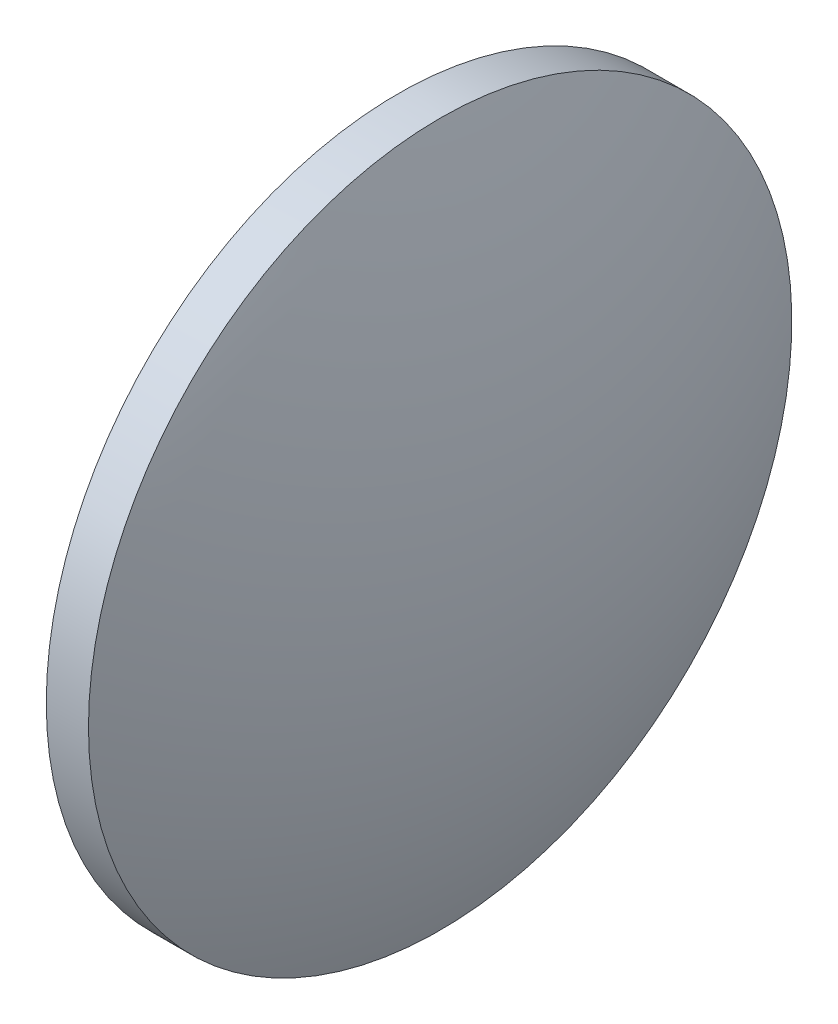
ISO-10303-21;
HEADER;
FILE_DESCRIPTION(('STEP AP214'),'2;1');
FILE_NAME('part.step','',(''),(''),'','','');
FILE_SCHEMA(('AUTOMOTIVE_DESIGN { 1 0 10303 214 1 1 1 1 }'));
ENDSEC;
DATA;
#1=APPLICATION_CONTEXT('core data for automotive mechanical design processes');
#2=APPLICATION_PROTOCOL_DEFINITION('international standard','automotive_design',2000,#1);
#3=PRODUCT_CONTEXT('',#1,'mechanical');
#4=PRODUCT('Part','Part','',(#3));
#5=PRODUCT_RELATED_PRODUCT_CATEGORY('part','',(#4));
#6=PRODUCT_DEFINITION_FORMATION('','',#4);
#7=PRODUCT_DEFINITION_CONTEXT('part definition',#1,'design');
#8=PRODUCT_DEFINITION('design','',#6,#7);
#9=PRODUCT_DEFINITION_SHAPE('','',#8);
#10=(LENGTH_UNIT() NAMED_UNIT(*) SI_UNIT(.MILLI.,.METRE.));
#11=(NAMED_UNIT(*) PLANE_ANGLE_UNIT() SI_UNIT($,.RADIAN.));
#12=(NAMED_UNIT(*) SI_UNIT($,.STERADIAN.) SOLID_ANGLE_UNIT());
#13=UNCERTAINTY_MEASURE_WITH_UNIT(LENGTH_MEASURE(1.E-05),#10,'distance_accuracy_value','');
#14=(GEOMETRIC_REPRESENTATION_CONTEXT(3) GLOBAL_UNCERTAINTY_ASSIGNED_CONTEXT((#13)) GLOBAL_UNIT_ASSIGNED_CONTEXT((#10,
#11,#12)) REPRESENTATION_CONTEXT('',''));
#15=CARTESIAN_POINT('',(0.,0.,0.));
#16=DIRECTION('',(0.,0.,1.));
#17=DIRECTION('',(1.,0.,0.));
#18=AXIS2_PLACEMENT_3D('',#15,#16,#17);
#19=CARTESIAN_POINT('',(521.162815002526,7.57456525703877,0.));
#20=DIRECTION('',(-1.,0.,0.));
#21=DIRECTION('',(0.,1.,0.));
#22=AXIS2_PLACEMENT_3D('',#19,#20,#21);
#23=SPHERICAL_SURFACE('',#22,32.5000000000001);
#24=CARTESIAN_POINT('',(551.162815002526,7.57456525703878,0.));
#25=DIRECTION('',(-1.,0.,0.));
#26=DIRECTION('',(0.,0.,1.));
#27=AXIS2_PLACEMENT_3D('',#24,#25,#26);
#28=CIRCLE('',#27,12.5);
#29=CARTESIAN_POINT('',(551.162815002526,7.57456525703878,12.5));
#30=VERTEX_POINT('',#29);
#31=EDGE_CURVE('E10',#30,#30,#28,.T.);
#32=ORIENTED_EDGE('',*,*,#31,.F.);
#33=EDGE_LOOP('',(#32));
#34=FACE_BOUND('',#33,.T.);
#35=ADVANCED_FACE('F35',(#34),#23,.T.);
#36=CARTESIAN_POINT('',(547.633707424089,7.57456525703878,0.));
#37=DIRECTION('',(-1.,0.,0.));
#38=DIRECTION('',(0.,0.,1.));
#39=AXIS2_PLACEMENT_3D('',#36,#37,#38);
#40=CYLINDRICAL_SURFACE('',#39,12.5);
#41=CARTESIAN_POINT('',(549.662815002526,7.57456525703878,0.));
#42=DIRECTION('',(-1.,0.,0.));
#43=DIRECTION('',(0.,0.,1.));
#44=AXIS2_PLACEMENT_3D('',#41,#42,#43);
#45=CIRCLE('',#44,12.5);
#46=CARTESIAN_POINT('',(549.662815002526,7.57456525703878,12.5));
#47=VERTEX_POINT('',#46);
#48=EDGE_CURVE('E41',#47,#47,#45,.T.);
#49=ORIENTED_EDGE('',*,*,#48,.F.);
#50=EDGE_LOOP('',(#49));
#51=FACE_BOUND('',#50,.T.);
#52=ORIENTED_EDGE('',*,*,#31,.T.);
#53=EDGE_LOOP('',(#52));
#54=FACE_BOUND('',#53,.T.);
#55=ADVANCED_FACE('F49',(#51,#54),#40,.T.);
#56=CARTESIAN_POINT('',(549.662815002526,7.57456525703878,0.));
#57=DIRECTION('',(1.,0.,0.));
#58=DIRECTION('',(0.,0.,-1.));
#59=AXIS2_PLACEMENT_3D('',#56,#57,#58);
#60=PLANE('',#59);
#61=ORIENTED_EDGE('',*,*,#48,.T.);
#62=EDGE_LOOP('',(#61));
#63=FACE_BOUND('',#62,.T.);
#64=ADVANCED_FACE('F47',(#63),#60,.F.);
#65=CLOSED_SHELL('',(#35,#55,#64));
#66=MANIFOLD_SOLID_BREP('B2',#65);
#67=ADVANCED_BREP_SHAPE_REPRESENTATION('',(#18,#66),#14);
#68=SHAPE_DEFINITION_REPRESENTATION(#9,#67);
ENDSEC;
END-ISO-10303-21;
